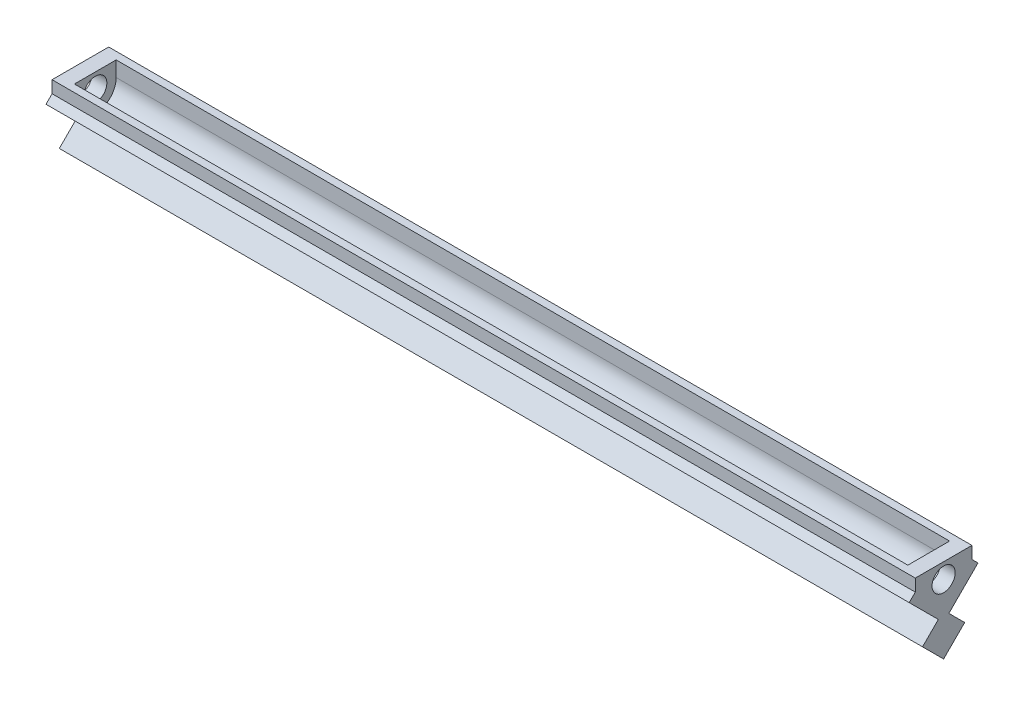
ISO-10303-21;
HEADER;
FILE_DESCRIPTION(('STEP AP214'),'2;1');
FILE_NAME('part.step','',(''),(''),'','','');
FILE_SCHEMA(('AUTOMOTIVE_DESIGN { 1 0 10303 214 1 1 1 1 }'));
ENDSEC;
DATA;
#1=APPLICATION_CONTEXT('core data for automotive mechanical design processes');
#2=APPLICATION_PROTOCOL_DEFINITION('international standard','automotive_design',2000,#1);
#3=PRODUCT_CONTEXT('',#1,'mechanical');
#4=PRODUCT('Part','Part','',(#3));
#5=PRODUCT_RELATED_PRODUCT_CATEGORY('part','',(#4));
#6=PRODUCT_DEFINITION_FORMATION('','',#4);
#7=PRODUCT_DEFINITION_CONTEXT('part definition',#1,'design');
#8=PRODUCT_DEFINITION('design','',#6,#7);
#9=PRODUCT_DEFINITION_SHAPE('','',#8);
#10=(LENGTH_UNIT() NAMED_UNIT(*) SI_UNIT(.MILLI.,.METRE.));
#11=(NAMED_UNIT(*) PLANE_ANGLE_UNIT() SI_UNIT($,.RADIAN.));
#12=(NAMED_UNIT(*) SI_UNIT($,.STERADIAN.) SOLID_ANGLE_UNIT());
#13=UNCERTAINTY_MEASURE_WITH_UNIT(LENGTH_MEASURE(1.E-05),#10,'distance_accuracy_value','');
#14=(GEOMETRIC_REPRESENTATION_CONTEXT(3) GLOBAL_UNCERTAINTY_ASSIGNED_CONTEXT((#13)) GLOBAL_UNIT_ASSIGNED_CONTEXT((#10,
#11,#12)) REPRESENTATION_CONTEXT('',''));
#15=CARTESIAN_POINT('',(0.,0.,0.));
#16=DIRECTION('',(0.,0.,1.));
#17=DIRECTION('',(1.,0.,0.));
#18=AXIS2_PLACEMENT_3D('',#15,#16,#17);
#19=CARTESIAN_POINT('',(-18.4008869908068,-149.907185268329,1.24627570184135));
#20=DIRECTION('',(0.,0.707106781186548,0.707106781186547));
#21=DIRECTION('',(0.,-0.707106781186547,0.707106781186548));
#22=AXIS2_PLACEMENT_3D('',#19,#20,#21);
#23=PLANE('',#22);
#24=DIRECTION('',(0.,0.707106781186547,-0.707106781186548));
#25=VECTOR('',#24,1.);
#26=CARTESIAN_POINT('',(-23.1633869908069,-149.907185268329,1.24627570184137));
#27=LINE('',#26,#25);
#28=CARTESIAN_POINT('',(-23.1633869908069,-153.274781313729,4.61387174724228));
#29=VERTEX_POINT('',#28);
#30=CARTESIAN_POINT('',(-23.1633869908069,-152.460909566487,3.80000000000012));
#31=VERTEX_POINT('',#30);
#32=EDGE_CURVE('E51',#29,#31,#27,.T.);
#33=ORIENTED_EDGE('',*,*,#32,.T.);
#34=DIRECTION('',(-1.,0.,0.));
#35=VECTOR('',#34,1.);
#36=CARTESIAN_POINT('',(-18.4008869908068,-152.460909566487,3.80000000000018));
#37=LINE('',#36,#35);
#38=CARTESIAN_POINT('',(-138.967906757284,-152.460909566487,3.80000000000016));
#39=VERTEX_POINT('',#38);
#40=EDGE_CURVE('E12',#31,#39,#37,.T.);
#41=ORIENTED_EDGE('',*,*,#40,.T.);
#42=DIRECTION('',(0.,0.707106781186547,-0.707106781186548));
#43=VECTOR('',#42,1.);
#44=CARTESIAN_POINT('',(-138.967906757284,-149.907185268328,1.24627570184121));
#45=LINE('',#44,#43);
#46=CARTESIAN_POINT('',(-138.967906757284,-153.274781313729,4.61387174724222));
#47=VERTEX_POINT('',#46);
#48=EDGE_CURVE('E160',#47,#39,#45,.T.);
#49=ORIENTED_EDGE('',*,*,#48,.F.);
#50=DIRECTION('',(-1.,0.,0.));
#51=VECTOR('',#50,1.);
#52=CARTESIAN_POINT('',(-18.4008869908068,-153.274781313729,4.61387174724228));
#53=LINE('',#52,#51);
#54=EDGE_CURVE('E230',#29,#47,#53,.T.);
#55=ORIENTED_EDGE('',*,*,#54,.F.);
#56=EDGE_LOOP('',(#33,#41,#49,#55));
#57=FACE_BOUND('',#56,.T.);
#58=ADVANCED_FACE('F37',(#57),#23,.T.);
#59=CARTESIAN_POINT('',(-23.1633869908077,-1.34994884858255E-13,0.));
#60=DIRECTION('',(1.,0.,0.));
#61=DIRECTION('',(0.,1.,0.));
#62=AXIS2_PLACEMENT_3D('',#59,#60,#61);
#63=PLANE('',#62);
#64=DIRECTION('',(0.,1.,0.));
#65=VECTOR('',#64,1.);
#66=CARTESIAN_POINT('',(-23.1633869908069,-152.827906313731,3.80000000000018));
#67=LINE('',#66,#65);
#68=CARTESIAN_POINT('',(-23.1633869908068,-150.827906313731,3.80000000000017));
#69=VERTEX_POINT('',#68);
#70=EDGE_CURVE('E162',#31,#69,#67,.T.);
#71=ORIENTED_EDGE('',*,*,#70,.F.);
#72=ORIENTED_EDGE('',*,*,#32,.F.);
#73=DIRECTION('',(0.,0.707106781186548,0.707106781186547));
#74=VECTOR('',#73,1.);
#75=CARTESIAN_POINT('',(-23.1633869908073,-78.9443265304858,78.9443265304858));
#76=LINE('',#75,#74);
#77=CARTESIAN_POINT('',(-23.1633869908068,-157.181546279785,0.707106781186586));
#78=VERTEX_POINT('',#77);
#79=EDGE_CURVE('E219',#78,#29,#76,.T.);
#80=ORIENTED_EDGE('',*,*,#79,.F.);
#81=DIRECTION('',(0.,0.707106781186547,-0.707106781186548));
#82=VECTOR('',#81,1.);
#83=CARTESIAN_POINT('',(-23.1633869908068,-157.181546279785,0.707106781186642));
#84=LINE('',#83,#82);
#85=CARTESIAN_POINT('',(-23.1633869908068,-159.302866623345,2.82842712474617));
#86=VERTEX_POINT('',#85);
#87=EDGE_CURVE('E218',#86,#78,#84,.T.);
#88=ORIENTED_EDGE('',*,*,#87,.F.);
#89=DIRECTION('',(0.,0.707106781186547,0.707106781186548));
#90=VECTOR('',#89,1.);
#91=CARTESIAN_POINT('',(-23.1633869908068,-162.13129374809,4.04948477075849E-13));
#92=LINE('',#91,#90);
#93=CARTESIAN_POINT('',(-23.163386990807,-162.131293748091,0.));
#94=VERTEX_POINT('',#93);
#95=EDGE_CURVE('E215',#94,#86,#92,.T.);
#96=ORIENTED_EDGE('',*,*,#95,.F.);
#97=DIRECTION('',(0.,-0.707106781186547,0.707106781186548));
#98=VECTOR('',#97,1.);
#99=CARTESIAN_POINT('',(-23.1633869908068,-162.131293748091,5.39943361934099E-13));
#100=LINE('',#99,#98);
#101=CARTESIAN_POINT('',(-23.1633869908068,-159.302866623345,-2.82842712474607));
#102=VERTEX_POINT('',#101);
#103=EDGE_CURVE('E263',#102,#94,#100,.T.);
#104=ORIENTED_EDGE('',*,*,#103,.F.);
#105=DIRECTION('',(0.,0.707106781186548,0.707106781186547));
#106=VECTOR('',#105,1.);
#107=CARTESIAN_POINT('',(-23.1633869908068,-157.181546279785,-0.707106781186446));
#108=LINE('',#107,#106);
#109=CARTESIAN_POINT('',(-23.1633869908068,-157.181546279785,-0.707106781186397));
#110=VERTEX_POINT('',#109);
#111=EDGE_CURVE('E266',#102,#110,#108,.T.);
#112=ORIENTED_EDGE('',*,*,#111,.T.);
#113=DIRECTION('',(0.,-0.707106781186547,0.707106781186548));
#114=VECTOR('',#113,1.);
#115=CARTESIAN_POINT('',(-23.1633869908073,-78.944326530486,-78.9443265304856));
#116=LINE('',#115,#114);
#117=CARTESIAN_POINT('',(-23.1633869908069,-153.274781313729,-4.6138717472421));
#118=VERTEX_POINT('',#117);
#119=EDGE_CURVE('E223',#118,#110,#116,.T.);
#120=ORIENTED_EDGE('',*,*,#119,.F.);
#121=DIRECTION('',(0.,0.707106781186548,0.707106781186547));
#122=VECTOR('',#121,1.);
#123=CARTESIAN_POINT('',(-23.1633869908069,-149.907185268329,-1.24627570184118));
#124=LINE('',#123,#122);
#125=CARTESIAN_POINT('',(-23.1633869908068,-152.460909566487,-3.80000000000001));
#126=VERTEX_POINT('',#125);
#127=EDGE_CURVE('E214',#118,#126,#124,.T.);
#128=ORIENTED_EDGE('',*,*,#127,.T.);
#129=DIRECTION('',(0.,1.,0.));
#130=VECTOR('',#129,1.);
#131=CARTESIAN_POINT('',(-23.1633869908069,-152.827906313731,-3.8));
#132=LINE('',#131,#130);
#133=CARTESIAN_POINT('',(-23.1633869908068,-150.827906313731,-3.8));
#134=VERTEX_POINT('',#133);
#135=EDGE_CURVE('E177',#126,#134,#132,.T.);
#136=ORIENTED_EDGE('',*,*,#135,.T.);
#137=DIRECTION('',(0.,0.,-1.));
#138=VECTOR('',#137,1.);
#139=CARTESIAN_POINT('',(-23.1633869908069,-150.827906313731,2.16699674724113));
#140=LINE('',#139,#138);
#141=EDGE_CURVE('E152',#69,#134,#140,.T.);
#142=ORIENTED_EDGE('',*,*,#141,.F.);
#143=EDGE_LOOP('',(#71,#72,#80,#88,#96,#104,#112,#120,#128,#136,#142));
#144=FACE_BOUND('',#143,.T.);
#145=CARTESIAN_POINT('',(-23.1633869908069,-152.877906313731,0.));
#146=DIRECTION('',(1.,0.,0.));
#147=DIRECTION('',(0.,1.,0.));
#148=AXIS2_PLACEMENT_3D('',#145,#146,#147);
#149=CIRCLE('',#148,1.55);
#150=CARTESIAN_POINT('',(-23.1633869908069,-151.327906313731,0.));
#151=VERTEX_POINT('',#150);
#152=EDGE_CURVE('E191',#151,#151,#149,.T.);
#153=ORIENTED_EDGE('',*,*,#152,.F.);
#154=EDGE_LOOP('',(#153));
#155=FACE_BOUND('',#154,.T.);
#156=ADVANCED_FACE('F282',(#144,#155),#63,.T.);
#157=CARTESIAN_POINT('',(162.131293748091,-162.131293748091,0.));
#158=DIRECTION('',(0.,-0.707106781186548,-0.707106781186547));
#159=DIRECTION('',(-1.,0.,0.));
#160=AXIS2_PLACEMENT_3D('',#157,#158,#159);
#161=PLANE('',#160);
#162=DIRECTION('',(-1.,0.,0.));
#163=VECTOR('',#162,1.);
#164=CARTESIAN_POINT('',(162.131293748091,-159.302866623345,-2.82842712474583));
#165=LINE('',#164,#163);
#166=CARTESIAN_POINT('',(-138.967906757284,-159.302866623345,-2.82842712474623));
#167=VERTEX_POINT('',#166);
#168=EDGE_CURVE('E225',#102,#167,#165,.T.);
#169=ORIENTED_EDGE('',*,*,#168,.F.);
#170=ORIENTED_EDGE('',*,*,#103,.T.);
#171=DIRECTION('',(-1.,0.,0.));
#172=VECTOR('',#171,1.);
#173=CARTESIAN_POINT('',(0.,-162.131293748091,0.));
#174=LINE('',#173,#172);
#175=CARTESIAN_POINT('',(-138.967906757284,-162.131293748091,0.));
#176=VERTEX_POINT('',#175);
#177=EDGE_CURVE('E254',#94,#176,#174,.T.);
#178=ORIENTED_EDGE('',*,*,#177,.T.);
#179=DIRECTION('',(0.,-0.707106781186547,0.707106781186548));
#180=VECTOR('',#179,1.);
#181=CARTESIAN_POINT('',(-138.967906757284,-162.13129374809,-4.38697198290412E-13));
#182=LINE('',#181,#180);
#183=EDGE_CURVE('E242',#167,#176,#182,.T.);
#184=ORIENTED_EDGE('',*,*,#183,.F.);
#185=EDGE_LOOP('',(#169,#170,#178,#184));
#186=FACE_BOUND('',#185,.T.);
#187=ADVANCED_FACE('F307',(#186),#161,.T.);
#188=CARTESIAN_POINT('',(-138.967906757283,1.61979390830338E-12,1.21484543122753E-12));
#189=DIRECTION('',(1.,0.,0.));
#190=DIRECTION('',(0.,1.,0.));
#191=AXIS2_PLACEMENT_3D('',#188,#189,#190);
#192=PLANE('',#191);
#193=ORIENTED_EDGE('',*,*,#48,.T.);
#194=DIRECTION('',(0.,1.,0.));
#195=VECTOR('',#194,1.);
#196=CARTESIAN_POINT('',(-138.967906757284,-152.827906313729,3.80000000000007));
#197=LINE('',#196,#195);
#198=CARTESIAN_POINT('',(-138.967906757284,-150.827906313729,3.80000000000007));
#199=VERTEX_POINT('',#198);
#200=EDGE_CURVE('E156',#39,#199,#197,.T.);
#201=ORIENTED_EDGE('',*,*,#200,.T.);
#202=DIRECTION('',(0.,0.,-1.));
#203=VECTOR('',#202,1.);
#204=CARTESIAN_POINT('',(-138.967906757284,-150.827906313729,2.16699674724221));
#205=LINE('',#204,#203);
#206=CARTESIAN_POINT('',(-138.967906757284,-150.827906313729,-3.8));
#207=VERTEX_POINT('',#206);
#208=EDGE_CURVE('E141',#199,#207,#205,.T.);
#209=ORIENTED_EDGE('',*,*,#208,.T.);
#210=DIRECTION('',(0.,1.,0.));
#211=VECTOR('',#210,1.);
#212=CARTESIAN_POINT('',(-138.967906757284,-152.827906313729,-3.8));
#213=LINE('',#212,#211);
#214=CARTESIAN_POINT('',(-138.967906757284,-152.460909566487,-3.8));
#215=VERTEX_POINT('',#214);
#216=EDGE_CURVE('E178',#215,#207,#213,.T.);
#217=ORIENTED_EDGE('',*,*,#216,.F.);
#218=DIRECTION('',(0.,0.707106781186548,0.707106781186547));
#219=VECTOR('',#218,1.);
#220=CARTESIAN_POINT('',(-138.967906757284,-149.907185268327,-1.24627570184002));
#221=LINE('',#220,#219);
#222=CARTESIAN_POINT('',(-138.967906757284,-153.274781313729,-4.61387174724214));
#223=VERTEX_POINT('',#222);
#224=EDGE_CURVE('E229',#223,#215,#221,.T.);
#225=ORIENTED_EDGE('',*,*,#224,.F.);
#226=DIRECTION('',(0.,-0.707106781186547,0.707106781186548));
#227=VECTOR('',#226,1.);
#228=CARTESIAN_POINT('',(-138.967906757284,-78.9443265304857,-78.9443265304859));
#229=LINE('',#228,#227);
#230=CARTESIAN_POINT('',(-138.967906757284,-157.181546279785,-0.707106781186514));
#231=VERTEX_POINT('',#230);
#232=EDGE_CURVE('E245',#223,#231,#229,.T.);
#233=ORIENTED_EDGE('',*,*,#232,.T.);
#234=DIRECTION('',(0.,0.707106781186548,0.707106781186547));
#235=VECTOR('',#234,1.);
#236=CARTESIAN_POINT('',(-138.967906757284,-157.181546279784,-0.707106781185215));
#237=LINE('',#236,#235);
#238=EDGE_CURVE('E226',#167,#231,#237,.T.);
#239=ORIENTED_EDGE('',*,*,#238,.F.);
#240=ORIENTED_EDGE('',*,*,#183,.T.);
#241=DIRECTION('',(0.,0.707106781186547,0.707106781186548));
#242=VECTOR('',#241,1.);
#243=CARTESIAN_POINT('',(-138.967906757284,-162.131293748091,-2.36241048501932E-13));
#244=LINE('',#243,#242);
#245=CARTESIAN_POINT('',(-138.967906757284,-159.302866623344,2.82842712474627));
#246=VERTEX_POINT('',#245);
#247=EDGE_CURVE('E239',#176,#246,#244,.T.);
#248=ORIENTED_EDGE('',*,*,#247,.T.);
#249=DIRECTION('',(0.,0.707106781186547,-0.707106781186548));
#250=VECTOR('',#249,1.);
#251=CARTESIAN_POINT('',(-138.967906757284,-157.181546279785,0.707106781186507));
#252=LINE('',#251,#250);
#253=CARTESIAN_POINT('',(-138.967906757284,-157.181546279785,0.7071067811866));
#254=VERTEX_POINT('',#253);
#255=EDGE_CURVE('E236',#246,#254,#252,.T.);
#256=ORIENTED_EDGE('',*,*,#255,.T.);
#257=DIRECTION('',(0.,0.707106781186548,0.707106781186547));
#258=VECTOR('',#257,1.);
#259=CARTESIAN_POINT('',(-138.967906757283,-78.9443265304842,78.9443265304871));
#260=LINE('',#259,#258);
#261=EDGE_CURVE('E233',#254,#47,#260,.T.);
#262=ORIENTED_EDGE('',*,*,#261,.T.);
#263=EDGE_LOOP('',(#193,#201,#209,#217,#225,#233,#239,#240,#248,#256,#262));
#264=FACE_BOUND('',#263,.T.);
#265=CARTESIAN_POINT('',(-138.967906757284,-152.877906313731,0.));
#266=DIRECTION('',(1.,0.,0.));
#267=DIRECTION('',(0.,1.,0.));
#268=AXIS2_PLACEMENT_3D('',#265,#266,#267);
#269=CIRCLE('',#268,1.55);
#270=CARTESIAN_POINT('',(-138.967906757284,-151.327906313731,0.));
#271=VERTEX_POINT('',#270);
#272=EDGE_CURVE('E180',#271,#271,#269,.T.);
#273=ORIENTED_EDGE('',*,*,#272,.T.);
#274=EDGE_LOOP('',(#273));
#275=FACE_BOUND('',#274,.T.);
#276=ADVANCED_FACE('F157',(#264,#275),#192,.F.);
#277=CARTESIAN_POINT('',(-1.38619950483484E-13,-78.9443265304858,78.9443265304858));
#278=DIRECTION('',(0.,-0.707106781186547,0.707106781186548));
#279=DIRECTION('',(0.,-0.707106781186548,-0.707106781186547));
#280=AXIS2_PLACEMENT_3D('',#277,#278,#279);
#281=PLANE('',#280);
#282=DIRECTION('',(-1.,0.,0.));
#283=VECTOR('',#282,1.);
#284=CARTESIAN_POINT('',(-7.72740661031265,-157.181546279785,0.707106781186584));
#285=LINE('',#284,#283);
#286=EDGE_CURVE('E250',#78,#254,#285,.T.);
#287=ORIENTED_EDGE('',*,*,#286,.F.);
#288=ORIENTED_EDGE('',*,*,#79,.T.);
#289=ORIENTED_EDGE('',*,*,#54,.T.);
#290=ORIENTED_EDGE('',*,*,#261,.F.);
#291=EDGE_LOOP('',(#287,#288,#289,#290));
#292=FACE_BOUND('',#291,.T.);
#293=ADVANCED_FACE('F311',(#292),#281,.T.);
#294=CARTESIAN_POINT('',(-162.131293748091,-162.131293748091,0.));
#295=DIRECTION('',(0.,-0.707106781186548,0.707106781186547));
#296=DIRECTION('',(1.,0.,0.));
#297=AXIS2_PLACEMENT_3D('',#294,#295,#296);
#298=PLANE('',#297);
#299=ORIENTED_EDGE('',*,*,#177,.F.);
#300=ORIENTED_EDGE('',*,*,#95,.T.);
#301=DIRECTION('',(-1.,0.,0.));
#302=VECTOR('',#301,1.);
#303=CARTESIAN_POINT('',(-162.131293748091,-159.302866623344,2.82842712474629));
#304=LINE('',#303,#302);
#305=EDGE_CURVE('E252',#86,#246,#304,.T.);
#306=ORIENTED_EDGE('',*,*,#305,.T.);
#307=ORIENTED_EDGE('',*,*,#247,.F.);
#308=EDGE_LOOP('',(#299,#300,#306,#307));
#309=FACE_BOUND('',#308,.T.);
#310=ADVANCED_FACE('F313',(#309),#298,.T.);
#311=CARTESIAN_POINT('',(-7.72740661031265,-157.181546279785,0.707106781186584));
#312=DIRECTION('',(0.,0.707106781186548,0.707106781186547));
#313=DIRECTION('',(0.,-0.707106781186547,0.707106781186548));
#314=AXIS2_PLACEMENT_3D('',#311,#312,#313);
#315=PLANE('',#314);
#316=ORIENTED_EDGE('',*,*,#305,.F.);
#317=ORIENTED_EDGE('',*,*,#87,.T.);
#318=ORIENTED_EDGE('',*,*,#286,.T.);
#319=ORIENTED_EDGE('',*,*,#255,.F.);
#320=EDGE_LOOP('',(#316,#317,#318,#319));
#321=FACE_BOUND('',#320,.T.);
#322=ADVANCED_FACE('F316',(#321),#315,.T.);
#323=CARTESIAN_POINT('',(0.,-78.9443265304859,-78.9443265304857));
#324=DIRECTION('',(0.,-0.707106781186548,-0.707106781186547));
#325=DIRECTION('',(0.,-0.707106781186547,0.707106781186548));
#326=AXIS2_PLACEMENT_3D('',#323,#324,#325);
#327=PLANE('',#326);
#328=DIRECTION('',(-1.,0.,0.));
#329=VECTOR('',#328,1.);
#330=CARTESIAN_POINT('',(-18.4008869908068,-153.274781313729,-4.6138717472421));
#331=LINE('',#330,#329);
#332=EDGE_CURVE('E256',#118,#223,#331,.T.);
#333=ORIENTED_EDGE('',*,*,#332,.F.);
#334=ORIENTED_EDGE('',*,*,#119,.T.);
#335=DIRECTION('',(-1.,0.,0.));
#336=VECTOR('',#335,1.);
#337=CARTESIAN_POINT('',(-7.72740661031264,-157.181546279785,-0.707106781186381));
#338=LINE('',#337,#336);
#339=EDGE_CURVE('E258',#110,#231,#338,.T.);
#340=ORIENTED_EDGE('',*,*,#339,.T.);
#341=ORIENTED_EDGE('',*,*,#232,.F.);
#342=EDGE_LOOP('',(#333,#334,#340,#341));
#343=FACE_BOUND('',#342,.T.);
#344=ADVANCED_FACE('F287',(#343),#327,.T.);
#345=CARTESIAN_POINT('',(-18.4008869908068,-149.907185268329,-1.24627570184117));
#346=DIRECTION('',(0.,-0.707106781186547,0.707106781186548));
#347=DIRECTION('',(0.,-0.707106781186548,-0.707106781186547));
#348=AXIS2_PLACEMENT_3D('',#345,#346,#347);
#349=PLANE('',#348);
#350=ORIENTED_EDGE('',*,*,#224,.T.);
#351=DIRECTION('',(1.,0.,0.));
#352=VECTOR('',#351,1.);
#353=CARTESIAN_POINT('',(-18.4008869908068,-152.460909566487,-3.8));
#354=LINE('',#353,#352);
#355=EDGE_CURVE('E45',#215,#126,#354,.T.);
#356=ORIENTED_EDGE('',*,*,#355,.T.);
#357=ORIENTED_EDGE('',*,*,#127,.F.);
#358=ORIENTED_EDGE('',*,*,#332,.T.);
#359=EDGE_LOOP('',(#350,#356,#357,#358));
#360=FACE_BOUND('',#359,.T.);
#361=ADVANCED_FACE('F277',(#360),#349,.F.);
#362=CARTESIAN_POINT('',(-7.72740661031264,-157.181546279785,-0.707106781186381));
#363=DIRECTION('',(0.,-0.707106781186547,0.707106781186548));
#364=DIRECTION('',(0.,-0.707106781186548,-0.707106781186547));
#365=AXIS2_PLACEMENT_3D('',#362,#363,#364);
#366=PLANE('',#365);
#367=ORIENTED_EDGE('',*,*,#111,.F.);
#368=ORIENTED_EDGE('',*,*,#168,.T.);
#369=ORIENTED_EDGE('',*,*,#238,.T.);
#370=ORIENTED_EDGE('',*,*,#339,.F.);
#371=EDGE_LOOP('',(#367,#368,#369,#370));
#372=FACE_BOUND('',#371,.T.);
#373=ADVANCED_FACE('F39',(#372),#366,.F.);
#374=CARTESIAN_POINT('',(-15.3244172856311,-150.827906313731,2.16699674724113));
#375=DIRECTION('',(0.,1.,0.));
#376=DIRECTION('',(-1.,0.,0.));
#377=AXIS2_PLACEMENT_3D('',#374,#375,#376);
#378=PLANE('',#377);
#379=ORIENTED_EDGE('',*,*,#208,.F.);
#380=DIRECTION('',(-1.,0.,0.));
#381=VECTOR('',#380,1.);
#382=CARTESIAN_POINT('',(-138.967906757284,-150.827906313729,3.80000000000007));
#383=LINE('',#382,#381);
#384=EDGE_CURVE('E146',#69,#199,#383,.T.);
#385=ORIENTED_EDGE('',*,*,#384,.F.);
#386=ORIENTED_EDGE('',*,*,#141,.T.);
#387=DIRECTION('',(-1.,0.,0.));
#388=VECTOR('',#387,1.);
#389=CARTESIAN_POINT('',(-138.967906757284,-150.827906313729,-3.8));
#390=LINE('',#389,#388);
#391=EDGE_CURVE('E148',#134,#207,#390,.T.);
#392=ORIENTED_EDGE('',*,*,#391,.T.);
#393=EDGE_LOOP('',(#379,#385,#386,#392));
#394=FACE_BOUND('',#393,.T.);
#395=DIRECTION('',(0.,0.,-1.));
#396=VECTOR('',#395,1.);
#397=CARTESIAN_POINT('',(-25.1633869908069,-150.827906313731,2.16699674724113));
#398=LINE('',#397,#396);
#399=CARTESIAN_POINT('',(-25.1633869908069,-150.827906313731,2.80000000000017));
#400=VERTEX_POINT('',#399);
#401=CARTESIAN_POINT('',(-25.1633869908069,-150.827906313731,-2.8));
#402=VERTEX_POINT('',#401);
#403=EDGE_CURVE('E273',#400,#402,#398,.T.);
#404=ORIENTED_EDGE('',*,*,#403,.F.);
#405=DIRECTION('',(1.,0.,0.));
#406=VECTOR('',#405,1.);
#407=CARTESIAN_POINT('',(-25.1633869908069,-150.827906313731,2.80000000000017));
#408=LINE('',#407,#406);
#409=CARTESIAN_POINT('',(-136.967906757284,-150.827906313729,2.80000000000007));
#410=VERTEX_POINT('',#409);
#411=EDGE_CURVE('E163',#410,#400,#408,.T.);
#412=ORIENTED_EDGE('',*,*,#411,.F.);
#413=DIRECTION('',(0.,0.,-1.));
#414=VECTOR('',#413,1.);
#415=CARTESIAN_POINT('',(-136.967906757284,-150.827906313729,2.1669967472422));
#416=LINE('',#415,#414);
#417=CARTESIAN_POINT('',(-136.967906757284,-150.827906313729,-2.8));
#418=VERTEX_POINT('',#417);
#419=EDGE_CURVE('E248',#410,#418,#416,.T.);
#420=ORIENTED_EDGE('',*,*,#419,.T.);
#421=DIRECTION('',(1.,0.,0.));
#422=VECTOR('',#421,1.);
#423=CARTESIAN_POINT('',(-25.1633869908069,-150.827906313731,-2.8));
#424=LINE('',#423,#422);
#425=EDGE_CURVE('E172',#418,#402,#424,.T.);
#426=ORIENTED_EDGE('',*,*,#425,.T.);
#427=EDGE_LOOP('',(#404,#412,#420,#426));
#428=FACE_BOUND('',#427,.T.);
#429=ADVANCED_FACE('F143',(#394,#428),#378,.T.);
#430=CARTESIAN_POINT('',(-148.448544921459,-150.827906313731,-2.8));
#431=DIRECTION('',(0.,0.,-1.));
#432=DIRECTION('',(0.,1.,0.));
#433=AXIS2_PLACEMENT_3D('',#430,#431,#432);
#434=PLANE('',#433);
#435=DIRECTION('',(0.,1.,0.));
#436=VECTOR('',#435,1.);
#437=CARTESIAN_POINT('',(-25.1633869908069,-150.827906313731,-2.8));
#438=LINE('',#437,#436);
#439=CARTESIAN_POINT('',(-25.1633869908069,-152.877906313731,-2.8));
#440=VERTEX_POINT('',#439);
#441=EDGE_CURVE('E206',#440,#402,#438,.T.);
#442=ORIENTED_EDGE('',*,*,#441,.T.);
#443=ORIENTED_EDGE('',*,*,#425,.F.);
#444=DIRECTION('',(0.,-1.,0.));
#445=VECTOR('',#444,1.);
#446=CARTESIAN_POINT('',(-136.967906757284,-150.827906313732,-2.8));
#447=LINE('',#446,#445);
#448=CARTESIAN_POINT('',(-136.967906757284,-152.877906313731,-2.8));
#449=VERTEX_POINT('',#448);
#450=EDGE_CURVE('E197',#418,#449,#447,.T.);
#451=ORIENTED_EDGE('',*,*,#450,.T.);
#452=DIRECTION('',(1.,0.,0.));
#453=VECTOR('',#452,1.);
#454=CARTESIAN_POINT('',(-148.448544921459,-152.877906313731,-2.8));
#455=LINE('',#454,#453);
#456=EDGE_CURVE('E200',#449,#440,#455,.T.);
#457=ORIENTED_EDGE('',*,*,#456,.T.);
#458=EDGE_LOOP('',(#442,#443,#451,#457));
#459=FACE_BOUND('',#458,.T.);
#460=ADVANCED_FACE('F330',(#459),#434,.F.);
#461=CARTESIAN_POINT('',(-148.448544921459,-150.827906313731,2.8));
#462=DIRECTION('',(0.,0.,1.));
#463=DIRECTION('',(0.,-1.,0.));
#464=AXIS2_PLACEMENT_3D('',#461,#462,#463);
#465=PLANE('',#464);
#466=DIRECTION('',(0.,1.,0.));
#467=VECTOR('',#466,1.);
#468=CARTESIAN_POINT('',(-136.967906757284,-150.827906313732,2.8));
#469=LINE('',#468,#467);
#470=CARTESIAN_POINT('',(-136.967906757284,-152.877906313731,2.8));
#471=VERTEX_POINT('',#470);
#472=EDGE_CURVE('E153',#471,#410,#469,.T.);
#473=ORIENTED_EDGE('',*,*,#472,.T.);
#474=ORIENTED_EDGE('',*,*,#411,.T.);
#475=DIRECTION('',(0.,-1.,0.));
#476=VECTOR('',#475,1.);
#477=CARTESIAN_POINT('',(-25.1633869908069,-150.827906313731,2.8));
#478=LINE('',#477,#476);
#479=CARTESIAN_POINT('',(-25.1633869908069,-152.877906313731,2.8));
#480=VERTEX_POINT('',#479);
#481=EDGE_CURVE('E194',#400,#480,#478,.T.);
#482=ORIENTED_EDGE('',*,*,#481,.T.);
#483=DIRECTION('',(1.,0.,0.));
#484=VECTOR('',#483,1.);
#485=CARTESIAN_POINT('',(-148.448544921459,-152.877906313731,2.8));
#486=LINE('',#485,#484);
#487=EDGE_CURVE('E209',#471,#480,#486,.T.);
#488=ORIENTED_EDGE('',*,*,#487,.F.);
#489=EDGE_LOOP('',(#473,#474,#482,#488));
#490=FACE_BOUND('',#489,.T.);
#491=ADVANCED_FACE('F351',(#490),#465,.F.);
#492=CARTESIAN_POINT('',(-148.448544921459,-152.877906313731,0.));
#493=DIRECTION('',(1.,0.,0.));
#494=DIRECTION('',(0.,1.,0.));
#495=AXIS2_PLACEMENT_3D('',#492,#493,#494);
#496=CYLINDRICAL_SURFACE('',#495,2.8);
#497=CARTESIAN_POINT('',(-136.967906757284,-152.877906313731,0.));
#498=DIRECTION('',(1.,0.,0.));
#499=DIRECTION('',(0.,1.,0.));
#500=AXIS2_PLACEMENT_3D('',#497,#498,#499);
#501=CIRCLE('',#500,2.8);
#502=EDGE_CURVE('E198',#449,#471,#501,.F.);
#503=ORIENTED_EDGE('',*,*,#502,.T.);
#504=ORIENTED_EDGE('',*,*,#487,.T.);
#505=CARTESIAN_POINT('',(-25.1633869908069,-152.877906313731,0.));
#506=DIRECTION('',(1.,0.,0.));
#507=DIRECTION('',(0.,1.,0.));
#508=AXIS2_PLACEMENT_3D('',#505,#506,#507);
#509=CIRCLE('',#508,2.8);
#510=EDGE_CURVE('E203',#480,#440,#509,.T.);
#511=ORIENTED_EDGE('',*,*,#510,.T.);
#512=ORIENTED_EDGE('',*,*,#456,.F.);
#513=EDGE_LOOP('',(#503,#504,#511,#512));
#514=FACE_BOUND('',#513,.T.);
#515=ADVANCED_FACE('F354',(#514),#496,.F.);
#516=CARTESIAN_POINT('',(-25.1633869908069,-150.827906313731,-1.00267016911459E-12));
#517=DIRECTION('',(1.,0.,0.));
#518=DIRECTION('',(0.,1.,0.));
#519=AXIS2_PLACEMENT_3D('',#516,#517,#518);
#520=PLANE('',#519);
#521=ORIENTED_EDGE('',*,*,#481,.F.);
#522=ORIENTED_EDGE('',*,*,#403,.T.);
#523=ORIENTED_EDGE('',*,*,#441,.F.);
#524=ORIENTED_EDGE('',*,*,#510,.F.);
#525=EDGE_LOOP('',(#521,#522,#523,#524));
#526=FACE_BOUND('',#525,.T.);
#527=CARTESIAN_POINT('',(-25.1633869908068,-152.877906313731,0.));
#528=DIRECTION('',(1.,0.,0.));
#529=DIRECTION('',(0.,1.,0.));
#530=AXIS2_PLACEMENT_3D('',#527,#528,#529);
#531=CIRCLE('',#530,1.55);
#532=CARTESIAN_POINT('',(-25.1633869908069,-151.327906313731,0.));
#533=VERTEX_POINT('',#532);
#534=EDGE_CURVE('E188',#533,#533,#531,.T.);
#535=ORIENTED_EDGE('',*,*,#534,.T.);
#536=EDGE_LOOP('',(#535));
#537=FACE_BOUND('',#536,.T.);
#538=ADVANCED_FACE('F358',(#526,#537),#520,.F.);
#539=CARTESIAN_POINT('',(-136.967906757283,1.59648213875744E-12,1.19736160406808E-12));
#540=DIRECTION('',(1.,0.,0.));
#541=DIRECTION('',(0.,1.,0.));
#542=AXIS2_PLACEMENT_3D('',#539,#540,#541);
#543=PLANE('',#542);
#544=ORIENTED_EDGE('',*,*,#419,.F.);
#545=ORIENTED_EDGE('',*,*,#472,.F.);
#546=ORIENTED_EDGE('',*,*,#502,.F.);
#547=ORIENTED_EDGE('',*,*,#450,.F.);
#548=EDGE_LOOP('',(#544,#545,#546,#547));
#549=FACE_BOUND('',#548,.T.);
#550=CARTESIAN_POINT('',(-136.967906757284,-152.877906313731,0.));
#551=DIRECTION('',(1.,0.,0.));
#552=DIRECTION('',(0.,1.,0.));
#553=AXIS2_PLACEMENT_3D('',#550,#551,#552);
#554=CIRCLE('',#553,1.55);
#555=CARTESIAN_POINT('',(-136.967906757284,-151.327906313731,0.));
#556=VERTEX_POINT('',#555);
#557=EDGE_CURVE('E185',#556,#556,#554,.T.);
#558=ORIENTED_EDGE('',*,*,#557,.F.);
#559=EDGE_LOOP('',(#558));
#560=FACE_BOUND('',#559,.T.);
#561=ADVANCED_FACE('F365',(#549,#560),#543,.T.);
#562=CARTESIAN_POINT('',(-138.967906757284,-152.877906313731,0.));
#563=DIRECTION('',(1.,0.,0.));
#564=DIRECTION('',(0.,1.,0.));
#565=AXIS2_PLACEMENT_3D('',#562,#563,#564);
#566=CYLINDRICAL_SURFACE('',#565,1.55);
#567=ORIENTED_EDGE('',*,*,#557,.T.);
#568=EDGE_LOOP('',(#567));
#569=FACE_BOUND('',#568,.T.);
#570=ORIENTED_EDGE('',*,*,#272,.F.);
#571=EDGE_LOOP('',(#570));
#572=FACE_BOUND('',#571,.T.);
#573=ADVANCED_FACE('F299',(#569,#572),#566,.F.);
#574=ORIENTED_EDGE('',*,*,#152,.T.);
#575=EDGE_LOOP('',(#574));
#576=FACE_BOUND('',#575,.T.);
#577=ORIENTED_EDGE('',*,*,#534,.F.);
#578=EDGE_LOOP('',(#577));
#579=FACE_BOUND('',#578,.T.);
#580=ADVANCED_FACE('F292',(#576,#579),#566,.F.);
#581=CARTESIAN_POINT('',(-138.967906757284,-152.827906313729,-3.8));
#582=DIRECTION('',(0.,0.,-1.));
#583=DIRECTION('',(0.,1.,0.));
#584=AXIS2_PLACEMENT_3D('',#581,#582,#583);
#585=PLANE('',#584);
#586=ORIENTED_EDGE('',*,*,#355,.F.);
#587=ORIENTED_EDGE('',*,*,#216,.T.);
#588=ORIENTED_EDGE('',*,*,#391,.F.);
#589=ORIENTED_EDGE('',*,*,#135,.F.);
#590=EDGE_LOOP('',(#586,#587,#588,#589));
#591=FACE_BOUND('',#590,.T.);
#592=ADVANCED_FACE('F290',(#591),#585,.T.);
#593=CARTESIAN_POINT('',(-138.967906757284,-152.827906313729,3.80000000000007));
#594=DIRECTION('',(0.,0.,-1.));
#595=DIRECTION('',(0.,1.,0.));
#596=AXIS2_PLACEMENT_3D('',#593,#594,#595);
#597=PLANE('',#596);
#598=ORIENTED_EDGE('',*,*,#40,.F.);
#599=ORIENTED_EDGE('',*,*,#70,.T.);
#600=ORIENTED_EDGE('',*,*,#384,.T.);
#601=ORIENTED_EDGE('',*,*,#200,.F.);
#602=EDGE_LOOP('',(#598,#599,#600,#601));
#603=FACE_BOUND('',#602,.T.);
#604=ADVANCED_FACE('F166',(#603),#597,.F.);
#605=CLOSED_SHELL('',(#58,#156,#187,#276,#293,#310,#322,#344,#361,#373,#429,#460,#491,#515,#538,
#561,#573,#580,#592,#604));
#606=MANIFOLD_SOLID_BREP('B2',#605);
#607=ADVANCED_BREP_SHAPE_REPRESENTATION('',(#18,#606),#14);
#608=SHAPE_DEFINITION_REPRESENTATION(#9,#607);
ENDSEC;
END-ISO-10303-21;
